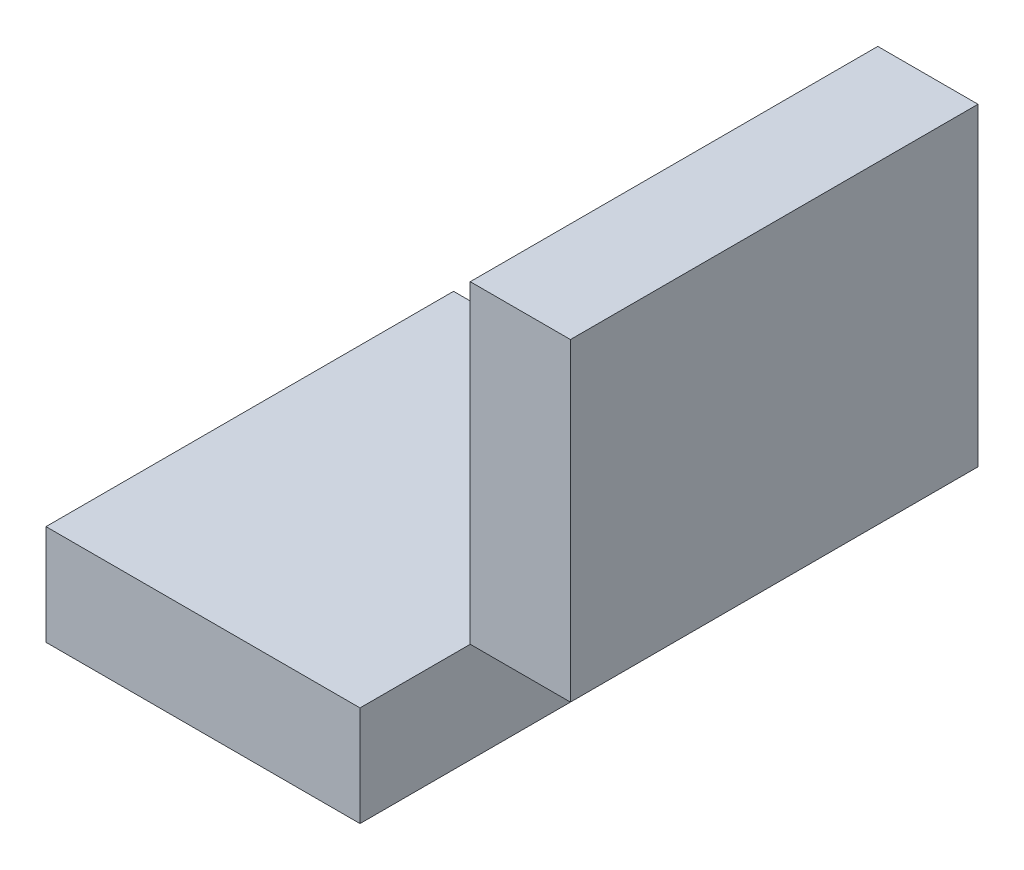
ISO-10303-21;
HEADER;
FILE_DESCRIPTION(('STEP AP214'),'2;1');
FILE_NAME('part.step','',(''),(''),'','','');
FILE_SCHEMA(('AUTOMOTIVE_DESIGN { 1 0 10303 214 1 1 1 1 }'));
ENDSEC;
DATA;
#1=APPLICATION_CONTEXT('core data for automotive mechanical design processes');
#2=APPLICATION_PROTOCOL_DEFINITION('international standard','automotive_design',2000,#1);
#3=PRODUCT_CONTEXT('',#1,'mechanical');
#4=PRODUCT('Part','Part','',(#3));
#5=PRODUCT_RELATED_PRODUCT_CATEGORY('part','',(#4));
#6=PRODUCT_DEFINITION_FORMATION('','',#4);
#7=PRODUCT_DEFINITION_CONTEXT('part definition',#1,'design');
#8=PRODUCT_DEFINITION('design','',#6,#7);
#9=PRODUCT_DEFINITION_SHAPE('','',#8);
#10=(LENGTH_UNIT() NAMED_UNIT(*) SI_UNIT(.MILLI.,.METRE.));
#11=(NAMED_UNIT(*) PLANE_ANGLE_UNIT() SI_UNIT($,.RADIAN.));
#12=(NAMED_UNIT(*) SI_UNIT($,.STERADIAN.) SOLID_ANGLE_UNIT());
#13=UNCERTAINTY_MEASURE_WITH_UNIT(LENGTH_MEASURE(1.E-05),#10,'distance_accuracy_value','');
#14=(GEOMETRIC_REPRESENTATION_CONTEXT(3) GLOBAL_UNCERTAINTY_ASSIGNED_CONTEXT((#13)) GLOBAL_UNIT_ASSIGNED_CONTEXT((#10,
#11,#12)) REPRESENTATION_CONTEXT('',''));
#15=CARTESIAN_POINT('',(0.,0.,0.));
#16=DIRECTION('',(0.,0.,1.));
#17=DIRECTION('',(1.,0.,0.));
#18=AXIS2_PLACEMENT_3D('',#15,#16,#17);
#19=CARTESIAN_POINT('',(4.7,-11.,0.));
#20=DIRECTION('',(0.,-1.,0.));
#21=DIRECTION('',(0.,0.,-1.));
#22=AXIS2_PLACEMENT_3D('',#19,#20,#21);
#23=PLANE('',#22);
#24=DIRECTION('',(0.,0.,1.));
#25=VECTOR('',#24,1.);
#26=CARTESIAN_POINT('',(-4.7,-11.,0.));
#27=LINE('',#26,#25);
#28=CARTESIAN_POINT('',(-4.7,-11.,0.));
#29=VERTEX_POINT('',#28);
#30=CARTESIAN_POINT('',(-4.7,-11.,12.2));
#31=VERTEX_POINT('',#30);
#32=EDGE_CURVE('P0_E19',#29,#31,#27,.T.);
#33=ORIENTED_EDGE('',*,*,#32,.F.);
#34=DIRECTION('',(1.,0.,0.));
#35=VECTOR('',#34,1.);
#36=CARTESIAN_POINT('',(-4.7,-11.,0.));
#37=LINE('',#36,#35);
#38=CARTESIAN_POINT('',(4.7,-11.,0.));
#39=VERTEX_POINT('',#38);
#40=EDGE_CURVE('P0_E79',#29,#39,#37,.T.);
#41=ORIENTED_EDGE('',*,*,#40,.T.);
#42=DIRECTION('',(0.,0.,-1.));
#43=VECTOR('',#42,1.);
#44=CARTESIAN_POINT('',(4.7,-11.,0.));
#45=LINE('',#44,#43);
#46=CARTESIAN_POINT('',(4.7,-11.,12.2));
#47=VERTEX_POINT('',#46);
#48=EDGE_CURVE('P0_E67',#47,#39,#45,.T.);
#49=ORIENTED_EDGE('',*,*,#48,.F.);
#50=DIRECTION('',(1.,0.,0.));
#51=VECTOR('',#50,1.);
#52=CARTESIAN_POINT('',(-4.7,-11.,12.2));
#53=LINE('',#52,#51);
#54=EDGE_CURVE('P0_E55',#31,#47,#53,.T.);
#55=ORIENTED_EDGE('',*,*,#54,.F.);
#56=EDGE_LOOP('',(#33,#41,#49,#55));
#57=FACE_BOUND('',#56,.T.);
#58=ADVANCED_FACE('P0_F16',(#57),#23,.T.);
#59=CARTESIAN_POINT('',(-4.7,-11.,0.));
#60=DIRECTION('',(-1.,0.,0.));
#61=DIRECTION('',(0.,0.,1.));
#62=AXIS2_PLACEMENT_3D('',#59,#60,#61);
#63=PLANE('',#62);
#64=DIRECTION('',(0.,0.,1.));
#65=VECTOR('',#64,1.);
#66=CARTESIAN_POINT('',(-4.7,-8.,0.));
#67=LINE('',#66,#65);
#68=CARTESIAN_POINT('',(-4.7,-8.,0.));
#69=VERTEX_POINT('',#68);
#70=CARTESIAN_POINT('',(-4.7,-8.,12.2));
#71=VERTEX_POINT('',#70);
#72=EDGE_CURVE('P0_E82',#69,#71,#67,.T.);
#73=ORIENTED_EDGE('',*,*,#72,.F.);
#74=DIRECTION('',(0.,1.,0.));
#75=VECTOR('',#74,1.);
#76=CARTESIAN_POINT('',(-4.7,-8.,0.));
#77=LINE('',#76,#75);
#78=EDGE_CURVE('P0_E64',#69,#29,#77,.F.);
#79=ORIENTED_EDGE('',*,*,#78,.T.);
#80=ORIENTED_EDGE('',*,*,#32,.T.);
#81=DIRECTION('',(0.,1.,0.));
#82=VECTOR('',#81,1.);
#83=CARTESIAN_POINT('',(-4.7,-8.,12.2));
#84=LINE('',#83,#82);
#85=EDGE_CURVE('P0_E61',#71,#31,#84,.F.);
#86=ORIENTED_EDGE('',*,*,#85,.F.);
#87=EDGE_LOOP('',(#73,#79,#80,#86));
#88=FACE_BOUND('',#87,.T.);
#89=ADVANCED_FACE('P0_F60',(#88),#63,.T.);
#90=CARTESIAN_POINT('',(-4.7,-8.,12.2));
#91=DIRECTION('',(0.,0.,1.));
#92=DIRECTION('',(1.,0.,0.));
#93=AXIS2_PLACEMENT_3D('',#90,#91,#92);
#94=PLANE('',#93);
#95=DIRECTION('',(0.,1.,0.));
#96=VECTOR('',#95,1.);
#97=CARTESIAN_POINT('',(4.7,-8.,12.2));
#98=LINE('',#97,#96);
#99=CARTESIAN_POINT('',(4.7,-8.,12.2));
#100=VERTEX_POINT('',#99);
#101=EDGE_CURVE('P0_E69',#100,#47,#98,.F.);
#102=ORIENTED_EDGE('',*,*,#101,.F.);
#103=DIRECTION('',(1.,0.,0.));
#104=VECTOR('',#103,1.);
#105=CARTESIAN_POINT('',(-4.7,-8.,12.2));
#106=LINE('',#105,#104);
#107=EDGE_CURVE('P0_E73',#71,#100,#106,.T.);
#108=ORIENTED_EDGE('',*,*,#107,.F.);
#109=ORIENTED_EDGE('',*,*,#85,.T.);
#110=ORIENTED_EDGE('',*,*,#54,.T.);
#111=EDGE_LOOP('',(#102,#108,#109,#110));
#112=FACE_BOUND('',#111,.T.);
#113=ADVANCED_FACE('P0_F71',(#112),#94,.T.);
#114=CARTESIAN_POINT('',(4.7,-8.,0.));
#115=DIRECTION('',(1.,0.,0.));
#116=DIRECTION('',(0.,0.,-1.));
#117=AXIS2_PLACEMENT_3D('',#114,#115,#116);
#118=PLANE('',#117);
#119=ORIENTED_EDGE('',*,*,#48,.T.);
#120=DIRECTION('',(0.,1.,0.));
#121=VECTOR('',#120,1.);
#122=CARTESIAN_POINT('',(4.7,-8.,0.));
#123=LINE('',#122,#121);
#124=CARTESIAN_POINT('',(4.7,-8.,0.));
#125=VERTEX_POINT('',#124);
#126=EDGE_CURVE('P0_E34',#39,#125,#123,.T.);
#127=ORIENTED_EDGE('',*,*,#126,.T.);
#128=DIRECTION('',(0.,0.,1.));
#129=VECTOR('',#128,1.);
#130=CARTESIAN_POINT('',(4.7,-8.,0.));
#131=LINE('',#130,#129);
#132=EDGE_CURVE('P0_E25',#100,#125,#131,.F.);
#133=ORIENTED_EDGE('',*,*,#132,.F.);
#134=ORIENTED_EDGE('',*,*,#101,.T.);
#135=EDGE_LOOP('',(#119,#127,#133,#134));
#136=FACE_BOUND('',#135,.T.);
#137=ADVANCED_FACE('P0_F88',(#136),#118,.T.);
#138=CARTESIAN_POINT('',(-4.7,-8.,0.));
#139=DIRECTION('',(0.,0.,1.));
#140=DIRECTION('',(1.,0.,0.));
#141=AXIS2_PLACEMENT_3D('',#138,#139,#140);
#142=PLANE('',#141);
#143=ORIENTED_EDGE('',*,*,#126,.F.);
#144=ORIENTED_EDGE('',*,*,#40,.F.);
#145=ORIENTED_EDGE('',*,*,#78,.F.);
#146=DIRECTION('',(1.,0.,0.));
#147=VECTOR('',#146,1.);
#148=CARTESIAN_POINT('',(-4.7,-8.,0.));
#149=LINE('',#148,#147);
#150=EDGE_CURVE('P0_E11',#125,#69,#149,.F.);
#151=ORIENTED_EDGE('',*,*,#150,.F.);
#152=EDGE_LOOP('',(#143,#144,#145,#151));
#153=FACE_BOUND('',#152,.T.);
#154=ADVANCED_FACE('P0_F90',(#153),#142,.F.);
#155=CARTESIAN_POINT('',(-4.7,-8.,0.));
#156=DIRECTION('',(0.,1.,0.));
#157=DIRECTION('',(0.,0.,1.));
#158=AXIS2_PLACEMENT_3D('',#155,#156,#157);
#159=PLANE('',#158);
#160=ORIENTED_EDGE('',*,*,#132,.T.);
#161=ORIENTED_EDGE('',*,*,#150,.T.);
#162=ORIENTED_EDGE('',*,*,#72,.T.);
#163=ORIENTED_EDGE('',*,*,#107,.T.);
#164=EDGE_LOOP('',(#160,#161,#162,#163));
#165=FACE_BOUND('',#164,.T.);
#166=ADVANCED_FACE('P0_F87',(#165),#159,.T.);
#167=CLOSED_SHELL('',(#58,#89,#113,#137,#154,#166));
#168=MANIFOLD_SOLID_BREP('P0_B1',#167);
#169=CARTESIAN_POINT('',(8.,-4.7,0.));
#170=DIRECTION('',(-1.,0.,0.));
#171=DIRECTION('',(0.,0.,1.));
#172=AXIS2_PLACEMENT_3D('',#169,#170,#171);
#173=PLANE('',#172);
#174=DIRECTION('',(0.,0.,1.));
#175=VECTOR('',#174,1.);
#176=CARTESIAN_POINT('',(8.,4.7,0.));
#177=LINE('',#176,#175);
#178=CARTESIAN_POINT('',(8.,4.7,0.));
#179=VERTEX_POINT('',#178);
#180=CARTESIAN_POINT('',(8.,4.7,12.2));
#181=VERTEX_POINT('',#180);
#182=EDGE_CURVE('P1_E19',#179,#181,#177,.T.);
#183=ORIENTED_EDGE('',*,*,#182,.F.);
#184=DIRECTION('',(0.,1.,0.));
#185=VECTOR('',#184,1.);
#186=CARTESIAN_POINT('',(8.,4.7,0.));
#187=LINE('',#186,#185);
#188=CARTESIAN_POINT('',(8.,-4.7,0.));
#189=VERTEX_POINT('',#188);
#190=EDGE_CURVE('P1_E78',#179,#189,#187,.F.);
#191=ORIENTED_EDGE('',*,*,#190,.T.);
#192=DIRECTION('',(0.,0.,-1.));
#193=VECTOR('',#192,1.);
#194=CARTESIAN_POINT('',(8.,-4.7,0.));
#195=LINE('',#194,#193);
#196=CARTESIAN_POINT('',(8.,-4.7,12.2));
#197=VERTEX_POINT('',#196);
#198=EDGE_CURVE('P1_E60',#197,#189,#195,.T.);
#199=ORIENTED_EDGE('',*,*,#198,.F.);
#200=DIRECTION('',(0.,1.,0.));
#201=VECTOR('',#200,1.);
#202=CARTESIAN_POINT('',(8.,4.7,12.2));
#203=LINE('',#202,#201);
#204=EDGE_CURVE('P1_E55',#181,#197,#203,.F.);
#205=ORIENTED_EDGE('',*,*,#204,.F.);
#206=EDGE_LOOP('',(#183,#191,#199,#205));
#207=FACE_BOUND('',#206,.T.);
#208=ADVANCED_FACE('P1_F16',(#207),#173,.T.);
#209=CARTESIAN_POINT('',(8.,4.7,0.));
#210=DIRECTION('',(0.,1.,0.));
#211=DIRECTION('',(0.,0.,1.));
#212=AXIS2_PLACEMENT_3D('',#209,#210,#211);
#213=PLANE('',#212);
#214=DIRECTION('',(0.,0.,-1.));
#215=VECTOR('',#214,1.);
#216=CARTESIAN_POINT('',(11.,4.7,0.));
#217=LINE('',#216,#215);
#218=CARTESIAN_POINT('',(11.,4.7,0.));
#219=VERTEX_POINT('',#218);
#220=CARTESIAN_POINT('',(11.,4.7,12.2));
#221=VERTEX_POINT('',#220);
#222=EDGE_CURVE('P1_E82',#219,#221,#217,.F.);
#223=ORIENTED_EDGE('',*,*,#222,.F.);
#224=DIRECTION('',(1.,0.,0.));
#225=VECTOR('',#224,1.);
#226=CARTESIAN_POINT('',(8.,4.7,0.));
#227=LINE('',#226,#225);
#228=EDGE_CURVE('P1_E67',#219,#179,#227,.F.);
#229=ORIENTED_EDGE('',*,*,#228,.T.);
#230=ORIENTED_EDGE('',*,*,#182,.T.);
#231=DIRECTION('',(1.,0.,0.));
#232=VECTOR('',#231,1.);
#233=CARTESIAN_POINT('',(8.,4.7,12.2));
#234=LINE('',#233,#232);
#235=EDGE_CURVE('P1_E62',#221,#181,#234,.F.);
#236=ORIENTED_EDGE('',*,*,#235,.F.);
#237=EDGE_LOOP('',(#223,#229,#230,#236));
#238=FACE_BOUND('',#237,.T.);
#239=ADVANCED_FACE('P1_F64',(#238),#213,.T.);
#240=CARTESIAN_POINT('',(8.,4.7,12.2));
#241=DIRECTION('',(0.,0.,1.));
#242=DIRECTION('',(1.,0.,0.));
#243=AXIS2_PLACEMENT_3D('',#240,#241,#242);
#244=PLANE('',#243);
#245=DIRECTION('',(0.,1.,0.));
#246=VECTOR('',#245,1.);
#247=CARTESIAN_POINT('',(11.,4.7,12.2));
#248=LINE('',#247,#246);
#249=CARTESIAN_POINT('',(11.,-4.7,12.2));
#250=VERTEX_POINT('',#249);
#251=EDGE_CURVE('P1_E71',#221,#250,#248,.F.);
#252=ORIENTED_EDGE('',*,*,#251,.F.);
#253=ORIENTED_EDGE('',*,*,#235,.T.);
#254=ORIENTED_EDGE('',*,*,#204,.T.);
#255=DIRECTION('',(1.,0.,0.));
#256=VECTOR('',#255,1.);
#257=CARTESIAN_POINT('',(11.,-4.7,12.2));
#258=LINE('',#257,#256);
#259=EDGE_CURVE('P1_E73',#250,#197,#258,.F.);
#260=ORIENTED_EDGE('',*,*,#259,.F.);
#261=EDGE_LOOP('',(#252,#253,#254,#260));
#262=FACE_BOUND('',#261,.T.);
#263=ADVANCED_FACE('P1_F69',(#262),#244,.T.);
#264=CARTESIAN_POINT('',(11.,-4.7,0.));
#265=DIRECTION('',(0.,-1.,0.));
#266=DIRECTION('',(0.,0.,-1.));
#267=AXIS2_PLACEMENT_3D('',#264,#265,#266);
#268=PLANE('',#267);
#269=ORIENTED_EDGE('',*,*,#198,.T.);
#270=DIRECTION('',(1.,0.,0.));
#271=VECTOR('',#270,1.);
#272=CARTESIAN_POINT('',(8.,-4.7,0.));
#273=LINE('',#272,#271);
#274=CARTESIAN_POINT('',(11.,-4.7,0.));
#275=VERTEX_POINT('',#274);
#276=EDGE_CURVE('P1_E34',#189,#275,#273,.T.);
#277=ORIENTED_EDGE('',*,*,#276,.T.);
#278=DIRECTION('',(0.,0.,-1.));
#279=VECTOR('',#278,1.);
#280=CARTESIAN_POINT('',(11.,-4.7,0.));
#281=LINE('',#280,#279);
#282=EDGE_CURVE('P1_E25',#250,#275,#281,.T.);
#283=ORIENTED_EDGE('',*,*,#282,.F.);
#284=ORIENTED_EDGE('',*,*,#259,.T.);
#285=EDGE_LOOP('',(#269,#277,#283,#284));
#286=FACE_BOUND('',#285,.T.);
#287=ADVANCED_FACE('P1_F88',(#286),#268,.T.);
#288=CARTESIAN_POINT('',(8.,4.7,0.));
#289=DIRECTION('',(0.,0.,1.));
#290=DIRECTION('',(1.,0.,0.));
#291=AXIS2_PLACEMENT_3D('',#288,#289,#290);
#292=PLANE('',#291);
#293=DIRECTION('',(0.,1.,0.));
#294=VECTOR('',#293,1.);
#295=CARTESIAN_POINT('',(11.,4.7,0.));
#296=LINE('',#295,#294);
#297=EDGE_CURVE('P1_E11',#275,#219,#296,.T.);
#298=ORIENTED_EDGE('',*,*,#297,.F.);
#299=ORIENTED_EDGE('',*,*,#276,.F.);
#300=ORIENTED_EDGE('',*,*,#190,.F.);
#301=ORIENTED_EDGE('',*,*,#228,.F.);
#302=EDGE_LOOP('',(#298,#299,#300,#301));
#303=FACE_BOUND('',#302,.T.);
#304=ADVANCED_FACE('P1_F90',(#303),#292,.F.);
#305=CARTESIAN_POINT('',(11.,4.7,0.));
#306=DIRECTION('',(1.,0.,0.));
#307=DIRECTION('',(0.,0.,-1.));
#308=AXIS2_PLACEMENT_3D('',#305,#306,#307);
#309=PLANE('',#308);
#310=ORIENTED_EDGE('',*,*,#282,.T.);
#311=ORIENTED_EDGE('',*,*,#297,.T.);
#312=ORIENTED_EDGE('',*,*,#222,.T.);
#313=ORIENTED_EDGE('',*,*,#251,.T.);
#314=EDGE_LOOP('',(#310,#311,#312,#313));
#315=FACE_BOUND('',#314,.T.);
#316=ADVANCED_FACE('P1_F87',(#315),#309,.T.);
#317=CLOSED_SHELL('',(#208,#239,#263,#287,#304,#316));
#318=MANIFOLD_SOLID_BREP('P1_B1',#317);
#319=ADVANCED_BREP_SHAPE_REPRESENTATION('',(#18,#168,#318),#14);
#320=SHAPE_DEFINITION_REPRESENTATION(#9,#319);
ENDSEC;
END-ISO-10303-21;
